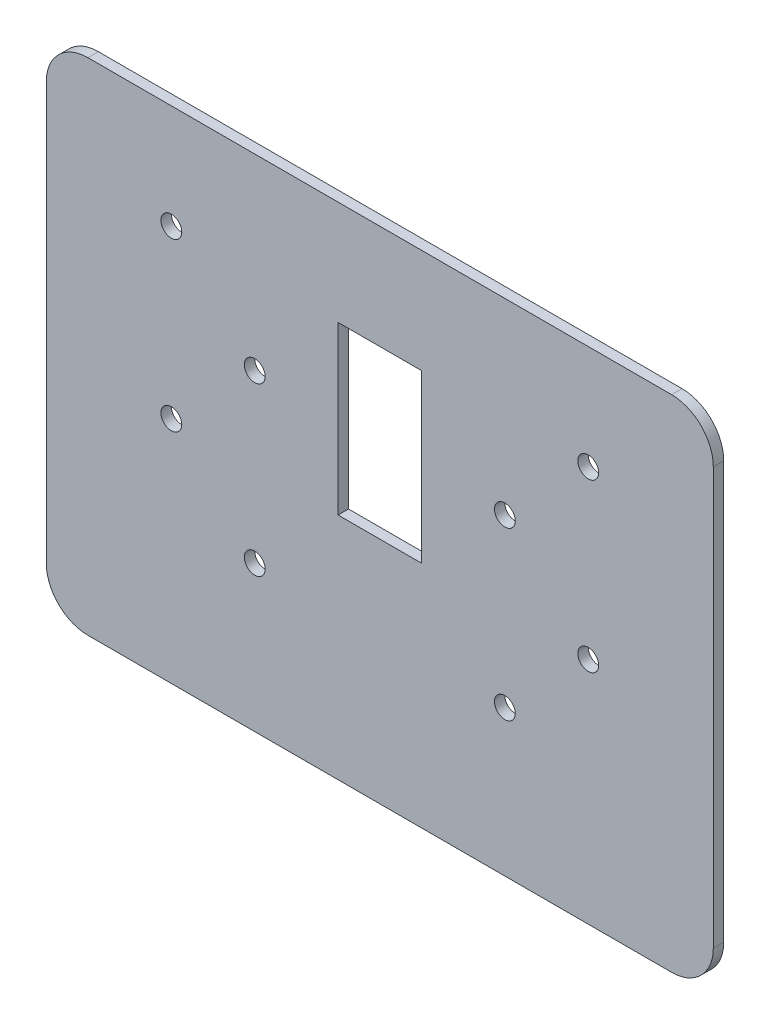
ISO-10303-21;
HEADER;
FILE_DESCRIPTION(('STEP AP214'),'2;1');
FILE_NAME('part.step','',(''),(''),'','','');
FILE_SCHEMA(('AUTOMOTIVE_DESIGN { 1 0 10303 214 1 1 1 1 }'));
ENDSEC;
DATA;
#1=APPLICATION_CONTEXT('core data for automotive mechanical design processes');
#2=APPLICATION_PROTOCOL_DEFINITION('international standard','automotive_design',2000,#1);
#3=PRODUCT_CONTEXT('',#1,'mechanical');
#4=PRODUCT('Part','Part','',(#3));
#5=PRODUCT_RELATED_PRODUCT_CATEGORY('part','',(#4));
#6=PRODUCT_DEFINITION_FORMATION('','',#4);
#7=PRODUCT_DEFINITION_CONTEXT('part definition',#1,'design');
#8=PRODUCT_DEFINITION('design','',#6,#7);
#9=PRODUCT_DEFINITION_SHAPE('','',#8);
#10=(LENGTH_UNIT() NAMED_UNIT(*) SI_UNIT(.MILLI.,.METRE.));
#11=(NAMED_UNIT(*) PLANE_ANGLE_UNIT() SI_UNIT($,.RADIAN.));
#12=(NAMED_UNIT(*) SI_UNIT($,.STERADIAN.) SOLID_ANGLE_UNIT());
#13=UNCERTAINTY_MEASURE_WITH_UNIT(LENGTH_MEASURE(1.E-05),#10,'distance_accuracy_value','');
#14=(GEOMETRIC_REPRESENTATION_CONTEXT(3) GLOBAL_UNCERTAINTY_ASSIGNED_CONTEXT((#13)) GLOBAL_UNIT_ASSIGNED_CONTEXT((#10,
#11,#12)) REPRESENTATION_CONTEXT('',''));
#15=CARTESIAN_POINT('',(0.,0.,0.));
#16=DIRECTION('',(0.,0.,1.));
#17=DIRECTION('',(1.,0.,0.));
#18=AXIS2_PLACEMENT_3D('',#15,#16,#17);
#19=CARTESIAN_POINT('',(0.,463.520831077741,3.175));
#20=DIRECTION('',(0.,1.,0.));
#21=DIRECTION('',(0.,0.,1.));
#22=AXIS2_PLACEMENT_3D('',#19,#20,#21);
#23=PLANE('',#22);
#24=DIRECTION('',(1.,0.,0.));
#25=VECTOR('',#24,1.);
#26=CARTESIAN_POINT('',(0.,463.520831077741,0.));
#27=LINE('',#26,#25);
#28=CARTESIAN_POINT('',(-392.019369125756,463.520831077741,0.));
#29=VERTEX_POINT('',#28);
#30=CARTESIAN_POINT('',(-214.219369125757,463.520831077741,0.));
#31=VERTEX_POINT('',#30);
#32=EDGE_CURVE('E193',#29,#31,#27,.T.);
#33=ORIENTED_EDGE('',*,*,#32,.F.);
#34=DIRECTION('',(0.,0.,-1.));
#35=VECTOR('',#34,1.);
#36=CARTESIAN_POINT('',(-392.019369125756,463.520831077741,3.175));
#37=LINE('',#36,#35);
#38=CARTESIAN_POINT('',(-392.019369125756,463.520831077741,3.175));
#39=VERTEX_POINT('',#38);
#40=EDGE_CURVE('E11',#39,#29,#37,.T.);
#41=ORIENTED_EDGE('',*,*,#40,.F.);
#42=DIRECTION('',(1.,0.,0.));
#43=VECTOR('',#42,1.);
#44=CARTESIAN_POINT('',(0.,463.520831077741,3.175));
#45=LINE('',#44,#43);
#46=CARTESIAN_POINT('',(-214.219369125757,463.520831077741,3.175));
#47=VERTEX_POINT('',#46);
#48=EDGE_CURVE('E275',#39,#47,#45,.T.);
#49=ORIENTED_EDGE('',*,*,#48,.T.);
#50=DIRECTION('',(0.,0.,-1.));
#51=VECTOR('',#50,1.);
#52=CARTESIAN_POINT('',(-214.219369125757,463.520831077741,3.175));
#53=LINE('',#52,#51);
#54=EDGE_CURVE('E54',#47,#31,#53,.T.);
#55=ORIENTED_EDGE('',*,*,#54,.T.);
#56=EDGE_LOOP('',(#33,#41,#49,#55));
#57=FACE_BOUND('',#56,.T.);
#58=ADVANCED_FACE('F35',(#57),#23,.T.);
#59=CARTESIAN_POINT('',(-392.019369125756,450.820831077741,3.175));
#60=DIRECTION('',(0.,0.,-1.));
#61=DIRECTION('',(-1.,0.,0.));
#62=AXIS2_PLACEMENT_3D('',#59,#60,#61);
#63=CYLINDRICAL_SURFACE('',#62,12.7);
#64=CARTESIAN_POINT('',(-392.019369125756,450.820831077741,0.));
#65=DIRECTION('',(0.,0.,1.));
#66=DIRECTION('',(1.,0.,0.));
#67=AXIS2_PLACEMENT_3D('',#64,#65,#66);
#68=CIRCLE('',#67,12.7);
#69=CARTESIAN_POINT('',(-404.719369125757,450.820831077741,0.));
#70=VERTEX_POINT('',#69);
#71=EDGE_CURVE('E195',#29,#70,#68,.T.);
#72=ORIENTED_EDGE('',*,*,#71,.T.);
#73=DIRECTION('',(0.,0.,-1.));
#74=VECTOR('',#73,1.);
#75=CARTESIAN_POINT('',(-404.719369125757,450.820831077741,3.175));
#76=LINE('',#75,#74);
#77=CARTESIAN_POINT('',(-404.719369125757,450.820831077741,3.175));
#78=VERTEX_POINT('',#77);
#79=EDGE_CURVE('E45',#78,#70,#76,.T.);
#80=ORIENTED_EDGE('',*,*,#79,.F.);
#81=CARTESIAN_POINT('',(-392.019369125756,450.820831077741,3.175));
#82=DIRECTION('',(0.,0.,1.));
#83=DIRECTION('',(1.,0.,0.));
#84=AXIS2_PLACEMENT_3D('',#81,#82,#83);
#85=CIRCLE('',#84,12.7);
#86=EDGE_CURVE('E277',#39,#78,#85,.T.);
#87=ORIENTED_EDGE('',*,*,#86,.F.);
#88=ORIENTED_EDGE('',*,*,#40,.T.);
#89=EDGE_LOOP('',(#72,#80,#87,#88));
#90=FACE_BOUND('',#89,.T.);
#91=ADVANCED_FACE('F306',(#90),#63,.T.);
#92=CARTESIAN_POINT('',(-404.719369125756,-3.53802174893844E-13,3.175));
#93=DIRECTION('',(1.,0.,0.));
#94=DIRECTION('',(0.,1.,0.));
#95=AXIS2_PLACEMENT_3D('',#92,#93,#94);
#96=PLANE('',#95);
#97=DIRECTION('',(0.,-1.,0.));
#98=VECTOR('',#97,1.);
#99=CARTESIAN_POINT('',(-404.719369125756,-3.53802174893844E-13,0.));
#100=LINE('',#99,#98);
#101=CARTESIAN_POINT('',(-404.719369125756,323.820831077741,0.));
#102=VERTEX_POINT('',#101);
#103=EDGE_CURVE('E198',#70,#102,#100,.T.);
#104=ORIENTED_EDGE('',*,*,#103,.T.);
#105=DIRECTION('',(0.,0.,-1.));
#106=VECTOR('',#105,1.);
#107=CARTESIAN_POINT('',(-404.719369125756,323.820831077741,3.175));
#108=LINE('',#107,#106);
#109=CARTESIAN_POINT('',(-404.719369125756,323.820831077741,3.175));
#110=VERTEX_POINT('',#109);
#111=EDGE_CURVE('E220',#110,#102,#108,.T.);
#112=ORIENTED_EDGE('',*,*,#111,.F.);
#113=DIRECTION('',(0.,-1.,0.));
#114=VECTOR('',#113,1.);
#115=CARTESIAN_POINT('',(-404.719369125756,-3.53802174893844E-13,3.175));
#116=LINE('',#115,#114);
#117=EDGE_CURVE('E280',#78,#110,#116,.T.);
#118=ORIENTED_EDGE('',*,*,#117,.F.);
#119=ORIENTED_EDGE('',*,*,#79,.T.);
#120=EDGE_LOOP('',(#104,#112,#118,#119));
#121=FACE_BOUND('',#120,.T.);
#122=ADVANCED_FACE('F311',(#121),#96,.F.);
#123=CARTESIAN_POINT('',(-392.019369125756,323.820831077741,3.175));
#124=DIRECTION('',(0.,0.,-1.));
#125=DIRECTION('',(-1.,0.,0.));
#126=AXIS2_PLACEMENT_3D('',#123,#124,#125);
#127=CYLINDRICAL_SURFACE('',#126,12.7);
#128=CARTESIAN_POINT('',(-392.019369125756,323.820831077741,0.));
#129=DIRECTION('',(0.,0.,1.));
#130=DIRECTION('',(1.,0.,0.));
#131=AXIS2_PLACEMENT_3D('',#128,#129,#130);
#132=CIRCLE('',#131,12.7);
#133=CARTESIAN_POINT('',(-392.019369125756,311.120831077741,0.));
#134=VERTEX_POINT('',#133);
#135=EDGE_CURVE('E201',#102,#134,#132,.T.);
#136=ORIENTED_EDGE('',*,*,#135,.T.);
#137=DIRECTION('',(0.,0.,-1.));
#138=VECTOR('',#137,1.);
#139=CARTESIAN_POINT('',(-392.019369125756,311.120831077741,3.175));
#140=LINE('',#139,#138);
#141=CARTESIAN_POINT('',(-392.019369125756,311.120831077741,3.175));
#142=VERTEX_POINT('',#141);
#143=EDGE_CURVE('E217',#142,#134,#140,.T.);
#144=ORIENTED_EDGE('',*,*,#143,.F.);
#145=CARTESIAN_POINT('',(-392.019369125756,323.820831077741,3.175));
#146=DIRECTION('',(0.,0.,1.));
#147=DIRECTION('',(1.,0.,0.));
#148=AXIS2_PLACEMENT_3D('',#145,#146,#147);
#149=CIRCLE('',#148,12.7);
#150=EDGE_CURVE('E283',#110,#142,#149,.T.);
#151=ORIENTED_EDGE('',*,*,#150,.F.);
#152=ORIENTED_EDGE('',*,*,#111,.T.);
#153=EDGE_LOOP('',(#136,#144,#151,#152));
#154=FACE_BOUND('',#153,.T.);
#155=ADVANCED_FACE('F287',(#154),#127,.T.);
#156=CARTESIAN_POINT('',(0.,311.120831077741,3.175));
#157=DIRECTION('',(0.,1.,0.));
#158=DIRECTION('',(0.,0.,1.));
#159=AXIS2_PLACEMENT_3D('',#156,#157,#158);
#160=PLANE('',#159);
#161=DIRECTION('',(1.,0.,0.));
#162=VECTOR('',#161,1.);
#163=CARTESIAN_POINT('',(0.,311.120831077741,0.));
#164=LINE('',#163,#162);
#165=CARTESIAN_POINT('',(-214.219369125757,311.120831077741,0.));
#166=VERTEX_POINT('',#165);
#167=EDGE_CURVE('E204',#134,#166,#164,.T.);
#168=ORIENTED_EDGE('',*,*,#167,.T.);
#169=DIRECTION('',(0.,0.,-1.));
#170=VECTOR('',#169,1.);
#171=CARTESIAN_POINT('',(-214.219369125757,311.120831077741,3.175));
#172=LINE('',#171,#170);
#173=CARTESIAN_POINT('',(-214.219369125757,311.120831077741,3.175));
#174=VERTEX_POINT('',#173);
#175=EDGE_CURVE('E151',#174,#166,#172,.T.);
#176=ORIENTED_EDGE('',*,*,#175,.F.);
#177=DIRECTION('',(1.,0.,0.));
#178=VECTOR('',#177,1.);
#179=CARTESIAN_POINT('',(0.,311.120831077741,3.175));
#180=LINE('',#179,#178);
#181=EDGE_CURVE('E140',#142,#174,#180,.T.);
#182=ORIENTED_EDGE('',*,*,#181,.F.);
#183=ORIENTED_EDGE('',*,*,#143,.T.);
#184=EDGE_LOOP('',(#168,#176,#182,#183));
#185=FACE_BOUND('',#184,.T.);
#186=ADVANCED_FACE('F289',(#185),#160,.F.);
#187=CARTESIAN_POINT('',(-214.219369125757,323.820831077741,3.175));
#188=DIRECTION('',(0.,0.,-1.));
#189=DIRECTION('',(-1.,0.,0.));
#190=AXIS2_PLACEMENT_3D('',#187,#188,#189);
#191=CYLINDRICAL_SURFACE('',#190,12.7);
#192=CARTESIAN_POINT('',(-214.219369125757,323.820831077741,0.));
#193=DIRECTION('',(0.,0.,1.));
#194=DIRECTION('',(1.,0.,0.));
#195=AXIS2_PLACEMENT_3D('',#192,#193,#194);
#196=CIRCLE('',#195,12.7);
#197=CARTESIAN_POINT('',(-201.519369125757,323.820831077741,0.));
#198=VERTEX_POINT('',#197);
#199=EDGE_CURVE('E148',#166,#198,#196,.T.);
#200=ORIENTED_EDGE('',*,*,#199,.T.);
#201=DIRECTION('',(0.,0.,-1.));
#202=VECTOR('',#201,1.);
#203=CARTESIAN_POINT('',(-201.519369125757,323.820831077741,3.175));
#204=LINE('',#203,#202);
#205=CARTESIAN_POINT('',(-201.519369125757,323.820831077741,3.175));
#206=VERTEX_POINT('',#205);
#207=EDGE_CURVE('E146',#206,#198,#204,.T.);
#208=ORIENTED_EDGE('',*,*,#207,.F.);
#209=CARTESIAN_POINT('',(-214.219369125757,323.820831077741,3.175));
#210=DIRECTION('',(0.,0.,1.));
#211=DIRECTION('',(1.,0.,0.));
#212=AXIS2_PLACEMENT_3D('',#209,#210,#211);
#213=CIRCLE('',#212,12.7);
#214=EDGE_CURVE('E132',#174,#206,#213,.T.);
#215=ORIENTED_EDGE('',*,*,#214,.F.);
#216=ORIENTED_EDGE('',*,*,#175,.T.);
#217=EDGE_LOOP('',(#200,#208,#215,#216));
#218=FACE_BOUND('',#217,.T.);
#219=ADVANCED_FACE('F147',(#218),#191,.T.);
#220=CARTESIAN_POINT('',(-201.519369125757,0.,3.175));
#221=DIRECTION('',(1.,0.,0.));
#222=DIRECTION('',(0.,1.,0.));
#223=AXIS2_PLACEMENT_3D('',#220,#221,#222);
#224=PLANE('',#223);
#225=DIRECTION('',(0.,-1.,0.));
#226=VECTOR('',#225,1.);
#227=CARTESIAN_POINT('',(-201.519369125757,0.,0.));
#228=LINE('',#227,#226);
#229=CARTESIAN_POINT('',(-201.519369125757,450.820831077741,0.));
#230=VERTEX_POINT('',#229);
#231=EDGE_CURVE('E208',#230,#198,#228,.T.);
#232=ORIENTED_EDGE('',*,*,#231,.F.);
#233=DIRECTION('',(0.,0.,-1.));
#234=VECTOR('',#233,1.);
#235=CARTESIAN_POINT('',(-201.519369125757,450.820831077741,3.175));
#236=LINE('',#235,#234);
#237=CARTESIAN_POINT('',(-201.519369125757,450.820831077741,3.175));
#238=VERTEX_POINT('',#237);
#239=EDGE_CURVE('E91',#238,#230,#236,.T.);
#240=ORIENTED_EDGE('',*,*,#239,.F.);
#241=DIRECTION('',(0.,-1.,0.));
#242=VECTOR('',#241,1.);
#243=CARTESIAN_POINT('',(-201.519369125757,0.,3.175));
#244=LINE('',#243,#242);
#245=EDGE_CURVE('E138',#238,#206,#244,.T.);
#246=ORIENTED_EDGE('',*,*,#245,.T.);
#247=ORIENTED_EDGE('',*,*,#207,.T.);
#248=EDGE_LOOP('',(#232,#240,#246,#247));
#249=FACE_BOUND('',#248,.T.);
#250=ADVANCED_FACE('F153',(#249),#224,.T.);
#251=CARTESIAN_POINT('',(0.,380.970831077741,3.175));
#252=DIRECTION('',(0.,-1.,0.));
#253=DIRECTION('',(0.,0.,-1.));
#254=AXIS2_PLACEMENT_3D('',#251,#252,#253);
#255=PLANE('',#254);
#256=DIRECTION('',(-1.,0.,0.));
#257=VECTOR('',#256,1.);
#258=CARTESIAN_POINT('',(0.,380.970831077741,0.));
#259=LINE('',#258,#257);
#260=CARTESIAN_POINT('',(-290.419369125757,380.970831077741,0.));
#261=VERTEX_POINT('',#260);
#262=CARTESIAN_POINT('',(-315.819369125757,380.970831077741,0.));
#263=VERTEX_POINT('',#262);
#264=EDGE_CURVE('E166',#261,#263,#259,.T.);
#265=ORIENTED_EDGE('',*,*,#264,.T.);
#266=DIRECTION('',(0.,0.,-1.));
#267=VECTOR('',#266,1.);
#268=CARTESIAN_POINT('',(-315.819369125757,380.970831077741,3.175));
#269=LINE('',#268,#267);
#270=CARTESIAN_POINT('',(-315.819369125757,380.970831077741,3.175));
#271=VERTEX_POINT('',#270);
#272=EDGE_CURVE('E39',#271,#263,#269,.T.);
#273=ORIENTED_EDGE('',*,*,#272,.F.);
#274=DIRECTION('',(-1.,0.,0.));
#275=VECTOR('',#274,1.);
#276=CARTESIAN_POINT('',(0.,380.970831077741,3.175));
#277=LINE('',#276,#275);
#278=CARTESIAN_POINT('',(-290.419369125757,380.970831077741,3.175));
#279=VERTEX_POINT('',#278);
#280=EDGE_CURVE('E499',#279,#271,#277,.T.);
#281=ORIENTED_EDGE('',*,*,#280,.F.);
#282=DIRECTION('',(0.,0.,-1.));
#283=VECTOR('',#282,1.);
#284=CARTESIAN_POINT('',(-290.419369125757,380.970831077741,3.175));
#285=LINE('',#284,#283);
#286=EDGE_CURVE('E156',#279,#261,#285,.T.);
#287=ORIENTED_EDGE('',*,*,#286,.T.);
#288=EDGE_LOOP('',(#265,#273,#281,#287));
#289=FACE_BOUND('',#288,.T.);
#290=ADVANCED_FACE('F239',(#289),#255,.F.);
#291=CARTESIAN_POINT('',(-315.819369125757,0.,3.175));
#292=DIRECTION('',(-1.,0.,0.));
#293=DIRECTION('',(0.,0.,1.));
#294=AXIS2_PLACEMENT_3D('',#291,#292,#293);
#295=PLANE('',#294);
#296=DIRECTION('',(0.,1.,0.));
#297=VECTOR('',#296,1.);
#298=CARTESIAN_POINT('',(-315.819369125757,0.,0.));
#299=LINE('',#298,#297);
#300=CARTESIAN_POINT('',(-315.819369125757,431.770831077741,0.));
#301=VERTEX_POINT('',#300);
#302=EDGE_CURVE('E169',#263,#301,#299,.T.);
#303=ORIENTED_EDGE('',*,*,#302,.T.);
#304=DIRECTION('',(0.,0.,-1.));
#305=VECTOR('',#304,1.);
#306=CARTESIAN_POINT('',(-315.819369125757,431.770831077741,3.175));
#307=LINE('',#306,#305);
#308=CARTESIAN_POINT('',(-315.819369125757,431.770831077741,3.175));
#309=VERTEX_POINT('',#308);
#310=EDGE_CURVE('E229',#309,#301,#307,.T.);
#311=ORIENTED_EDGE('',*,*,#310,.F.);
#312=DIRECTION('',(0.,1.,0.));
#313=VECTOR('',#312,1.);
#314=CARTESIAN_POINT('',(-315.819369125757,0.,3.175));
#315=LINE('',#314,#313);
#316=EDGE_CURVE('E104',#271,#309,#315,.T.);
#317=ORIENTED_EDGE('',*,*,#316,.F.);
#318=ORIENTED_EDGE('',*,*,#272,.T.);
#319=EDGE_LOOP('',(#303,#311,#317,#318));
#320=FACE_BOUND('',#319,.T.);
#321=ADVANCED_FACE('F235',(#320),#295,.F.);
#322=CARTESIAN_POINT('',(0.,431.770831077741,3.175));
#323=DIRECTION('',(0.,1.,0.));
#324=DIRECTION('',(0.,0.,1.));
#325=AXIS2_PLACEMENT_3D('',#322,#323,#324);
#326=PLANE('',#325);
#327=DIRECTION('',(1.,0.,0.));
#328=VECTOR('',#327,1.);
#329=CARTESIAN_POINT('',(0.,431.770831077741,0.));
#330=LINE('',#329,#328);
#331=CARTESIAN_POINT('',(-290.419369125757,431.770831077741,0.));
#332=VERTEX_POINT('',#331);
#333=EDGE_CURVE('E171',#301,#332,#330,.T.);
#334=ORIENTED_EDGE('',*,*,#333,.T.);
#335=DIRECTION('',(0.,0.,-1.));
#336=VECTOR('',#335,1.);
#337=CARTESIAN_POINT('',(-290.419369125757,431.770831077741,3.175));
#338=LINE('',#337,#336);
#339=CARTESIAN_POINT('',(-290.419369125757,431.770831077741,3.175));
#340=VERTEX_POINT('',#339);
#341=EDGE_CURVE('E227',#340,#332,#338,.T.);
#342=ORIENTED_EDGE('',*,*,#341,.F.);
#343=DIRECTION('',(1.,0.,0.));
#344=VECTOR('',#343,1.);
#345=CARTESIAN_POINT('',(0.,431.770831077741,3.175));
#346=LINE('',#345,#344);
#347=EDGE_CURVE('E253',#309,#340,#346,.T.);
#348=ORIENTED_EDGE('',*,*,#347,.F.);
#349=ORIENTED_EDGE('',*,*,#310,.T.);
#350=EDGE_LOOP('',(#334,#342,#348,#349));
#351=FACE_BOUND('',#350,.T.);
#352=ADVANCED_FACE('F246',(#351),#326,.F.);
#353=CARTESIAN_POINT('',(-366.619369125757,431.770831077741,3.175));
#354=DIRECTION('',(0.,0.,-1.));
#355=DIRECTION('',(-1.,0.,0.));
#356=AXIS2_PLACEMENT_3D('',#353,#354,#355);
#357=CYLINDRICAL_SURFACE('',#356,3.17499999999997);
#358=CARTESIAN_POINT('',(-366.619369125757,431.770831077741,3.175));
#359=DIRECTION('',(0.,0.,1.));
#360=DIRECTION('',(1.,0.,0.));
#361=AXIS2_PLACEMENT_3D('',#358,#359,#360);
#362=CIRCLE('',#361,3.17499999999997);
#363=CARTESIAN_POINT('',(-363.444369125757,431.770831077741,3.175));
#364=VERTEX_POINT('',#363);
#365=EDGE_CURVE('E272',#364,#364,#362,.T.);
#366=ORIENTED_EDGE('',*,*,#365,.T.);
#367=EDGE_LOOP('',(#366));
#368=FACE_BOUND('',#367,.T.);
#369=CARTESIAN_POINT('',(-366.619369125757,431.770831077741,0.));
#370=DIRECTION('',(0.,0.,1.));
#371=DIRECTION('',(1.,0.,0.));
#372=AXIS2_PLACEMENT_3D('',#369,#370,#371);
#373=CIRCLE('',#372,3.17499999999997);
#374=CARTESIAN_POINT('',(-363.444369125757,431.770831077741,0.));
#375=VERTEX_POINT('',#374);
#376=EDGE_CURVE('E190',#375,#375,#373,.T.);
#377=ORIENTED_EDGE('',*,*,#376,.F.);
#378=EDGE_LOOP('',(#377));
#379=FACE_BOUND('',#378,.T.);
#380=ADVANCED_FACE('F316',(#368,#379),#357,.F.);
#381=CARTESIAN_POINT('',(-341.219369125757,406.37083107774,3.175));
#382=DIRECTION('',(0.,0.,-1.));
#383=DIRECTION('',(-1.,0.,0.));
#384=AXIS2_PLACEMENT_3D('',#381,#382,#383);
#385=CYLINDRICAL_SURFACE('',#384,3.17499999999997);
#386=CARTESIAN_POINT('',(-341.219369125757,406.37083107774,3.175));
#387=DIRECTION('',(0.,0.,1.));
#388=DIRECTION('',(1.,0.,0.));
#389=AXIS2_PLACEMENT_3D('',#386,#387,#388);
#390=CIRCLE('',#389,3.17499999999997);
#391=CARTESIAN_POINT('',(-338.044369125757,406.37083107774,3.175));
#392=VERTEX_POINT('',#391);
#393=EDGE_CURVE('E269',#392,#392,#390,.T.);
#394=ORIENTED_EDGE('',*,*,#393,.T.);
#395=EDGE_LOOP('',(#394));
#396=FACE_BOUND('',#395,.T.);
#397=CARTESIAN_POINT('',(-341.219369125757,406.37083107774,0.));
#398=DIRECTION('',(0.,0.,1.));
#399=DIRECTION('',(1.,0.,0.));
#400=AXIS2_PLACEMENT_3D('',#397,#398,#399);
#401=CIRCLE('',#400,3.17499999999997);
#402=CARTESIAN_POINT('',(-338.044369125757,406.37083107774,0.));
#403=VERTEX_POINT('',#402);
#404=EDGE_CURVE('E187',#403,#403,#401,.T.);
#405=ORIENTED_EDGE('',*,*,#404,.F.);
#406=EDGE_LOOP('',(#405));
#407=FACE_BOUND('',#406,.T.);
#408=ADVANCED_FACE('F319',(#396,#407),#385,.F.);
#409=CARTESIAN_POINT('',(-366.619369125757,380.970831077741,3.175));
#410=DIRECTION('',(0.,0.,-1.));
#411=DIRECTION('',(-1.,0.,0.));
#412=AXIS2_PLACEMENT_3D('',#409,#410,#411);
#413=CYLINDRICAL_SURFACE('',#412,3.17499999999997);
#414=CARTESIAN_POINT('',(-366.619369125757,380.970831077741,3.175));
#415=DIRECTION('',(0.,0.,1.));
#416=DIRECTION('',(1.,0.,0.));
#417=AXIS2_PLACEMENT_3D('',#414,#415,#416);
#418=CIRCLE('',#417,3.17499999999997);
#419=CARTESIAN_POINT('',(-363.444369125757,380.970831077741,3.175));
#420=VERTEX_POINT('',#419);
#421=EDGE_CURVE('E266',#420,#420,#418,.T.);
#422=ORIENTED_EDGE('',*,*,#421,.T.);
#423=EDGE_LOOP('',(#422));
#424=FACE_BOUND('',#423,.T.);
#425=CARTESIAN_POINT('',(-366.619369125757,380.970831077741,0.));
#426=DIRECTION('',(0.,0.,1.));
#427=DIRECTION('',(1.,0.,0.));
#428=AXIS2_PLACEMENT_3D('',#425,#426,#427);
#429=CIRCLE('',#428,3.17499999999997);
#430=CARTESIAN_POINT('',(-363.444369125757,380.970831077741,0.));
#431=VERTEX_POINT('',#430);
#432=EDGE_CURVE('E184',#431,#431,#429,.T.);
#433=ORIENTED_EDGE('',*,*,#432,.F.);
#434=EDGE_LOOP('',(#433));
#435=FACE_BOUND('',#434,.T.);
#436=ADVANCED_FACE('F323',(#424,#435),#413,.F.);
#437=CARTESIAN_POINT('',(-265.019369125756,406.370831077741,3.175));
#438=DIRECTION('',(0.,0.,-1.));
#439=DIRECTION('',(-1.,0.,0.));
#440=AXIS2_PLACEMENT_3D('',#437,#438,#439);
#441=CYLINDRICAL_SURFACE('',#440,3.17499999999997);
#442=CARTESIAN_POINT('',(-265.019369125756,406.370831077741,3.175));
#443=DIRECTION('',(0.,0.,1.));
#444=DIRECTION('',(1.,0.,0.));
#445=AXIS2_PLACEMENT_3D('',#442,#443,#444);
#446=CIRCLE('',#445,3.17499999999997);
#447=CARTESIAN_POINT('',(-261.844369125757,406.370831077741,3.175));
#448=VERTEX_POINT('',#447);
#449=EDGE_CURVE('E263',#448,#448,#446,.T.);
#450=ORIENTED_EDGE('',*,*,#449,.T.);
#451=EDGE_LOOP('',(#450));
#452=FACE_BOUND('',#451,.T.);
#453=CARTESIAN_POINT('',(-265.019369125756,406.370831077741,0.));
#454=DIRECTION('',(0.,0.,1.));
#455=DIRECTION('',(1.,0.,0.));
#456=AXIS2_PLACEMENT_3D('',#453,#454,#455);
#457=CIRCLE('',#456,3.17499999999997);
#458=CARTESIAN_POINT('',(-261.844369125757,406.370831077741,0.));
#459=VERTEX_POINT('',#458);
#460=EDGE_CURVE('E181',#459,#459,#457,.T.);
#461=ORIENTED_EDGE('',*,*,#460,.F.);
#462=EDGE_LOOP('',(#461));
#463=FACE_BOUND('',#462,.T.);
#464=ADVANCED_FACE('F327',(#452,#463),#441,.F.);
#465=CARTESIAN_POINT('',(-239.619369125757,380.970831077741,3.175));
#466=DIRECTION('',(0.,0.,-1.));
#467=DIRECTION('',(-1.,0.,0.));
#468=AXIS2_PLACEMENT_3D('',#465,#466,#467);
#469=CYLINDRICAL_SURFACE('',#468,3.175);
#470=CARTESIAN_POINT('',(-239.619369125757,380.970831077741,3.175));
#471=DIRECTION('',(0.,0.,1.));
#472=DIRECTION('',(1.,0.,0.));
#473=AXIS2_PLACEMENT_3D('',#470,#471,#472);
#474=CIRCLE('',#473,3.175);
#475=CARTESIAN_POINT('',(-236.444369125757,380.970831077741,3.175));
#476=VERTEX_POINT('',#475);
#477=EDGE_CURVE('E256',#476,#476,#474,.T.);
#478=ORIENTED_EDGE('',*,*,#477,.T.);
#479=EDGE_LOOP('',(#478));
#480=FACE_BOUND('',#479,.T.);
#481=CARTESIAN_POINT('',(-239.619369125757,380.970831077741,0.));
#482=DIRECTION('',(0.,0.,1.));
#483=DIRECTION('',(1.,0.,0.));
#484=AXIS2_PLACEMENT_3D('',#481,#482,#483);
#485=CIRCLE('',#484,3.175);
#486=CARTESIAN_POINT('',(-236.444369125757,380.970831077741,0.));
#487=VERTEX_POINT('',#486);
#488=EDGE_CURVE('E178',#487,#487,#485,.T.);
#489=ORIENTED_EDGE('',*,*,#488,.F.);
#490=EDGE_LOOP('',(#489));
#491=FACE_BOUND('',#490,.T.);
#492=ADVANCED_FACE('F331',(#480,#491),#469,.F.);
#493=CARTESIAN_POINT('',(-239.619369125757,431.770831077741,3.175));
#494=DIRECTION('',(0.,0.,-1.));
#495=DIRECTION('',(-1.,0.,0.));
#496=AXIS2_PLACEMENT_3D('',#493,#494,#495);
#497=CYLINDRICAL_SURFACE('',#496,3.17499999999997);
#498=CARTESIAN_POINT('',(-239.619369125757,431.770831077741,3.175));
#499=DIRECTION('',(0.,0.,1.));
#500=DIRECTION('',(1.,0.,0.));
#501=AXIS2_PLACEMENT_3D('',#498,#499,#500);
#502=CIRCLE('',#501,3.17499999999997);
#503=CARTESIAN_POINT('',(-236.444369125757,431.770831077741,3.175));
#504=VERTEX_POINT('',#503);
#505=EDGE_CURVE('E252',#504,#504,#502,.T.);
#506=ORIENTED_EDGE('',*,*,#505,.T.);
#507=EDGE_LOOP('',(#506));
#508=FACE_BOUND('',#507,.T.);
#509=CARTESIAN_POINT('',(-239.619369125757,431.770831077741,0.));
#510=DIRECTION('',(0.,0.,1.));
#511=DIRECTION('',(1.,0.,0.));
#512=AXIS2_PLACEMENT_3D('',#509,#510,#511);
#513=CIRCLE('',#512,3.17499999999997);
#514=CARTESIAN_POINT('',(-236.444369125757,431.770831077741,0.));
#515=VERTEX_POINT('',#514);
#516=EDGE_CURVE('E175',#515,#515,#513,.T.);
#517=ORIENTED_EDGE('',*,*,#516,.F.);
#518=EDGE_LOOP('',(#517));
#519=FACE_BOUND('',#518,.T.);
#520=ADVANCED_FACE('F335',(#508,#519),#497,.F.);
#521=CARTESIAN_POINT('',(-290.419369125757,0.,3.175));
#522=DIRECTION('',(1.,0.,0.));
#523=DIRECTION('',(0.,0.,-1.));
#524=AXIS2_PLACEMENT_3D('',#521,#522,#523);
#525=PLANE('',#524);
#526=DIRECTION('',(0.,-1.,0.));
#527=VECTOR('',#526,1.);
#528=CARTESIAN_POINT('',(-290.419369125757,0.,0.));
#529=LINE('',#528,#527);
#530=EDGE_CURVE('E173',#332,#261,#529,.T.);
#531=ORIENTED_EDGE('',*,*,#530,.T.);
#532=ORIENTED_EDGE('',*,*,#286,.F.);
#533=DIRECTION('',(0.,-1.,0.));
#534=VECTOR('',#533,1.);
#535=CARTESIAN_POINT('',(-290.419369125757,0.,3.175));
#536=LINE('',#535,#534);
#537=EDGE_CURVE('E250',#340,#279,#536,.T.);
#538=ORIENTED_EDGE('',*,*,#537,.F.);
#539=ORIENTED_EDGE('',*,*,#341,.T.);
#540=EDGE_LOOP('',(#531,#532,#538,#539));
#541=FACE_BOUND('',#540,.T.);
#542=ADVANCED_FACE('F249',(#541),#525,.F.);
#543=CARTESIAN_POINT('',(-265.019369125757,355.570831077741,3.175));
#544=DIRECTION('',(0.,0.,-1.));
#545=DIRECTION('',(-1.,0.,0.));
#546=AXIS2_PLACEMENT_3D('',#543,#544,#545);
#547=CYLINDRICAL_SURFACE('',#546,3.17500000000002);
#548=CARTESIAN_POINT('',(-265.019369125757,355.570831077741,3.175));
#549=DIRECTION('',(0.,0.,1.));
#550=DIRECTION('',(1.,0.,0.));
#551=AXIS2_PLACEMENT_3D('',#548,#549,#550);
#552=CIRCLE('',#551,3.17500000000002);
#553=CARTESIAN_POINT('',(-261.844369125757,355.570831077741,3.175));
#554=VERTEX_POINT('',#553);
#555=EDGE_CURVE('E354',#554,#554,#552,.T.);
#556=ORIENTED_EDGE('',*,*,#555,.T.);
#557=EDGE_LOOP('',(#556));
#558=FACE_BOUND('',#557,.T.);
#559=CARTESIAN_POINT('',(-265.019369125757,355.570831077741,0.));
#560=DIRECTION('',(0.,0.,1.));
#561=DIRECTION('',(1.,0.,0.));
#562=AXIS2_PLACEMENT_3D('',#559,#560,#561);
#563=CIRCLE('',#562,3.17500000000002);
#564=CARTESIAN_POINT('',(-261.844369125757,355.570831077741,0.));
#565=VERTEX_POINT('',#564);
#566=EDGE_CURVE('E163',#565,#565,#563,.T.);
#567=ORIENTED_EDGE('',*,*,#566,.F.);
#568=EDGE_LOOP('',(#567));
#569=FACE_BOUND('',#568,.T.);
#570=ADVANCED_FACE('F301',(#558,#569),#547,.F.);
#571=CARTESIAN_POINT('',(-341.219369125756,355.57083107774,3.175));
#572=DIRECTION('',(0.,0.,-1.));
#573=DIRECTION('',(-1.,0.,0.));
#574=AXIS2_PLACEMENT_3D('',#571,#572,#573);
#575=CYLINDRICAL_SURFACE('',#574,3.17500000000002);
#576=CARTESIAN_POINT('',(-341.219369125756,355.57083107774,3.175));
#577=DIRECTION('',(0.,0.,1.));
#578=DIRECTION('',(1.,0.,0.));
#579=AXIS2_PLACEMENT_3D('',#576,#577,#578);
#580=CIRCLE('',#579,3.17500000000002);
#581=CARTESIAN_POINT('',(-338.044369125756,355.57083107774,3.175));
#582=VERTEX_POINT('',#581);
#583=EDGE_CURVE('E213',#582,#582,#580,.T.);
#584=ORIENTED_EDGE('',*,*,#583,.T.);
#585=EDGE_LOOP('',(#584));
#586=FACE_BOUND('',#585,.T.);
#587=CARTESIAN_POINT('',(-341.219369125756,355.57083107774,0.));
#588=DIRECTION('',(0.,0.,1.));
#589=DIRECTION('',(1.,0.,0.));
#590=AXIS2_PLACEMENT_3D('',#587,#588,#589);
#591=CIRCLE('',#590,3.17500000000002);
#592=CARTESIAN_POINT('',(-338.044369125756,355.57083107774,0.));
#593=VERTEX_POINT('',#592);
#594=EDGE_CURVE('E160',#593,#593,#591,.T.);
#595=ORIENTED_EDGE('',*,*,#594,.F.);
#596=EDGE_LOOP('',(#595));
#597=FACE_BOUND('',#596,.T.);
#598=ADVANCED_FACE('F37',(#586,#597),#575,.F.);
#599=CARTESIAN_POINT('',(-214.219369125757,450.820831077741,3.175));
#600=DIRECTION('',(0.,0.,-1.));
#601=DIRECTION('',(-1.,0.,0.));
#602=AXIS2_PLACEMENT_3D('',#599,#600,#601);
#603=CYLINDRICAL_SURFACE('',#602,12.7);
#604=CARTESIAN_POINT('',(-214.219369125757,450.820831077741,0.));
#605=DIRECTION('',(0.,0.,1.));
#606=DIRECTION('',(1.,0.,0.));
#607=AXIS2_PLACEMENT_3D('',#604,#605,#606);
#608=CIRCLE('',#607,12.7);
#609=EDGE_CURVE('E210',#31,#230,#608,.F.);
#610=ORIENTED_EDGE('',*,*,#609,.F.);
#611=ORIENTED_EDGE('',*,*,#54,.F.);
#612=CARTESIAN_POINT('',(-214.219369125757,450.820831077741,3.175));
#613=DIRECTION('',(0.,0.,1.));
#614=DIRECTION('',(1.,0.,0.));
#615=AXIS2_PLACEMENT_3D('',#612,#613,#614);
#616=CIRCLE('',#615,12.7);
#617=EDGE_CURVE('E154',#47,#238,#616,.F.);
#618=ORIENTED_EDGE('',*,*,#617,.T.);
#619=ORIENTED_EDGE('',*,*,#239,.T.);
#620=EDGE_LOOP('',(#610,#611,#618,#619));
#621=FACE_BOUND('',#620,.T.);
#622=ADVANCED_FACE('F292',(#621),#603,.T.);
#623=CARTESIAN_POINT('',(0.,0.,3.175));
#624=DIRECTION('',(0.,0.,1.));
#625=DIRECTION('',(1.,0.,0.));
#626=AXIS2_PLACEMENT_3D('',#623,#624,#625);
#627=PLANE('',#626);
#628=ORIENTED_EDGE('',*,*,#583,.F.);
#629=EDGE_LOOP('',(#628));
#630=FACE_BOUND('',#629,.T.);
#631=ORIENTED_EDGE('',*,*,#555,.F.);
#632=EDGE_LOOP('',(#631));
#633=FACE_BOUND('',#632,.T.);
#634=ORIENTED_EDGE('',*,*,#280,.T.);
#635=ORIENTED_EDGE('',*,*,#316,.T.);
#636=ORIENTED_EDGE('',*,*,#347,.T.);
#637=ORIENTED_EDGE('',*,*,#537,.T.);
#638=EDGE_LOOP('',(#634,#635,#636,#637));
#639=FACE_BOUND('',#638,.T.);
#640=ORIENTED_EDGE('',*,*,#505,.F.);
#641=EDGE_LOOP('',(#640));
#642=FACE_BOUND('',#641,.T.);
#643=ORIENTED_EDGE('',*,*,#477,.F.);
#644=EDGE_LOOP('',(#643));
#645=FACE_BOUND('',#644,.T.);
#646=ORIENTED_EDGE('',*,*,#449,.F.);
#647=EDGE_LOOP('',(#646));
#648=FACE_BOUND('',#647,.T.);
#649=ORIENTED_EDGE('',*,*,#421,.F.);
#650=EDGE_LOOP('',(#649));
#651=FACE_BOUND('',#650,.T.);
#652=ORIENTED_EDGE('',*,*,#393,.F.);
#653=EDGE_LOOP('',(#652));
#654=FACE_BOUND('',#653,.T.);
#655=ORIENTED_EDGE('',*,*,#365,.F.);
#656=EDGE_LOOP('',(#655));
#657=FACE_BOUND('',#656,.T.);
#658=ORIENTED_EDGE('',*,*,#48,.F.);
#659=ORIENTED_EDGE('',*,*,#86,.T.);
#660=ORIENTED_EDGE('',*,*,#117,.T.);
#661=ORIENTED_EDGE('',*,*,#150,.T.);
#662=ORIENTED_EDGE('',*,*,#181,.T.);
#663=ORIENTED_EDGE('',*,*,#214,.T.);
#664=ORIENTED_EDGE('',*,*,#245,.F.);
#665=ORIENTED_EDGE('',*,*,#617,.F.);
#666=EDGE_LOOP('',(#658,#659,#660,#661,#662,#663,#664,#665));
#667=FACE_BOUND('',#666,.T.);
#668=ADVANCED_FACE('F135',(#630,#633,#639,#642,#645,#648,#651,#654,#657,#667),#627,.T.);
#669=CARTESIAN_POINT('',(0.,0.,0.));
#670=DIRECTION('',(0.,0.,1.));
#671=DIRECTION('',(1.,0.,0.));
#672=AXIS2_PLACEMENT_3D('',#669,#670,#671);
#673=PLANE('',#672);
#674=ORIENTED_EDGE('',*,*,#594,.T.);
#675=EDGE_LOOP('',(#674));
#676=FACE_BOUND('',#675,.T.);
#677=ORIENTED_EDGE('',*,*,#566,.T.);
#678=EDGE_LOOP('',(#677));
#679=FACE_BOUND('',#678,.T.);
#680=ORIENTED_EDGE('',*,*,#264,.F.);
#681=ORIENTED_EDGE('',*,*,#530,.F.);
#682=ORIENTED_EDGE('',*,*,#333,.F.);
#683=ORIENTED_EDGE('',*,*,#302,.F.);
#684=EDGE_LOOP('',(#680,#681,#682,#683));
#685=FACE_BOUND('',#684,.T.);
#686=ORIENTED_EDGE('',*,*,#516,.T.);
#687=EDGE_LOOP('',(#686));
#688=FACE_BOUND('',#687,.T.);
#689=ORIENTED_EDGE('',*,*,#488,.T.);
#690=EDGE_LOOP('',(#689));
#691=FACE_BOUND('',#690,.T.);
#692=ORIENTED_EDGE('',*,*,#460,.T.);
#693=EDGE_LOOP('',(#692));
#694=FACE_BOUND('',#693,.T.);
#695=ORIENTED_EDGE('',*,*,#432,.T.);
#696=EDGE_LOOP('',(#695));
#697=FACE_BOUND('',#696,.T.);
#698=ORIENTED_EDGE('',*,*,#404,.T.);
#699=EDGE_LOOP('',(#698));
#700=FACE_BOUND('',#699,.T.);
#701=ORIENTED_EDGE('',*,*,#376,.T.);
#702=EDGE_LOOP('',(#701));
#703=FACE_BOUND('',#702,.T.);
#704=ORIENTED_EDGE('',*,*,#32,.T.);
#705=ORIENTED_EDGE('',*,*,#609,.T.);
#706=ORIENTED_EDGE('',*,*,#231,.T.);
#707=ORIENTED_EDGE('',*,*,#199,.F.);
#708=ORIENTED_EDGE('',*,*,#167,.F.);
#709=ORIENTED_EDGE('',*,*,#135,.F.);
#710=ORIENTED_EDGE('',*,*,#103,.F.);
#711=ORIENTED_EDGE('',*,*,#71,.F.);
#712=EDGE_LOOP('',(#704,#705,#706,#707,#708,#709,#710,#711));
#713=FACE_BOUND('',#712,.T.);
#714=ADVANCED_FACE('F243',(#676,#679,#685,#688,#691,#694,#697,#700,#703,#713),#673,.F.);
#715=CLOSED_SHELL('',(#58,#91,#122,#155,#186,#219,#250,#290,#321,#352,#380,#408,#436,#464,#492,
#520,#542,#570,#598,#622,#668,#714));
#716=MANIFOLD_SOLID_BREP('B2',#715);
#717=ADVANCED_BREP_SHAPE_REPRESENTATION('',(#18,#716),#14);
#718=SHAPE_DEFINITION_REPRESENTATION(#9,#717);
ENDSEC;
END-ISO-10303-21;
